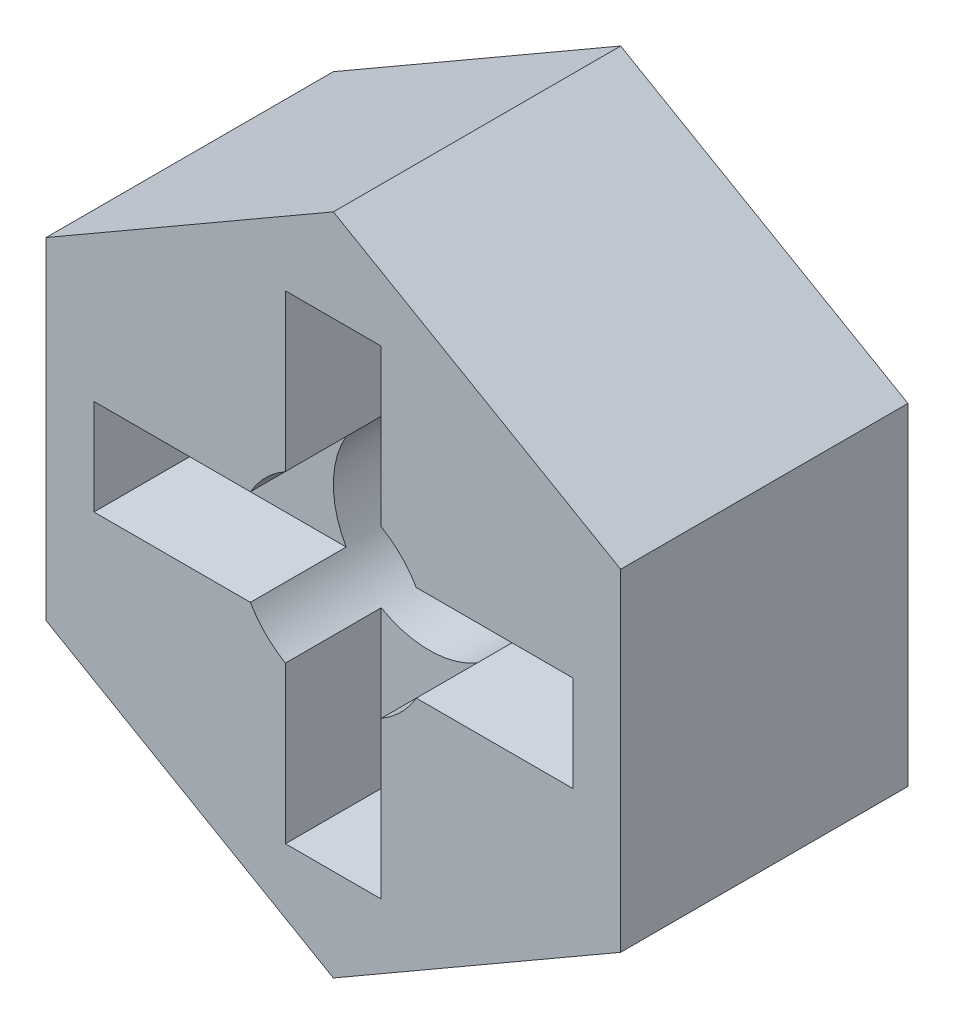
ISO-10303-21;
HEADER;
FILE_DESCRIPTION(('STEP AP214'),'2;1');
FILE_NAME('part.step','',(''),(''),'','','');
FILE_SCHEMA(('AUTOMOTIVE_DESIGN { 1 0 10303 214 1 1 1 1 }'));
ENDSEC;
DATA;
#1=APPLICATION_CONTEXT('core data for automotive mechanical design processes');
#2=APPLICATION_PROTOCOL_DEFINITION('international standard','automotive_design',2000,#1);
#3=PRODUCT_CONTEXT('',#1,'mechanical');
#4=PRODUCT('Part','Part','',(#3));
#5=PRODUCT_RELATED_PRODUCT_CATEGORY('part','',(#4));
#6=PRODUCT_DEFINITION_FORMATION('','',#4);
#7=PRODUCT_DEFINITION_CONTEXT('part definition',#1,'design');
#8=PRODUCT_DEFINITION('design','',#6,#7);
#9=PRODUCT_DEFINITION_SHAPE('','',#8);
#10=(LENGTH_UNIT() NAMED_UNIT(*) SI_UNIT(.MILLI.,.METRE.));
#11=(NAMED_UNIT(*) PLANE_ANGLE_UNIT() SI_UNIT($,.RADIAN.));
#12=(NAMED_UNIT(*) SI_UNIT($,.STERADIAN.) SOLID_ANGLE_UNIT());
#13=UNCERTAINTY_MEASURE_WITH_UNIT(LENGTH_MEASURE(1.E-05),#10,'distance_accuracy_value','');
#14=(GEOMETRIC_REPRESENTATION_CONTEXT(3) GLOBAL_UNCERTAINTY_ASSIGNED_CONTEXT((#13)) GLOBAL_UNIT_ASSIGNED_CONTEXT((#10,
#11,#12)) REPRESENTATION_CONTEXT('',''));
#15=CARTESIAN_POINT('',(0.,0.,0.));
#16=DIRECTION('',(0.,0.,1.));
#17=DIRECTION('',(1.,0.,0.));
#18=AXIS2_PLACEMENT_3D('',#15,#16,#17);
#19=CARTESIAN_POINT('',(6.00000000000001,3.46410161513783,0.));
#20=DIRECTION('',(0.,0.,-1.));
#21=DIRECTION('',(-1.,0.,0.));
#22=AXIS2_PLACEMENT_3D('',#19,#20,#21);
#23=PLANE('',#22);
#24=CARTESIAN_POINT('',(0.,0.,0.));
#25=DIRECTION('',(0.,0.,1.));
#26=DIRECTION('',(1.,0.,0.));
#27=AXIS2_PLACEMENT_3D('',#24,#25,#26);
#28=CIRCLE('',#27,2.);
#29=CARTESIAN_POINT('',(2.,0.,0.));
#30=VERTEX_POINT('',#29);
#31=EDGE_CURVE('E254',#30,#30,#28,.T.);
#32=ORIENTED_EDGE('',*,*,#31,.T.);
#33=EDGE_LOOP('',(#32));
#34=FACE_BOUND('',#33,.T.);
#35=CARTESIAN_POINT('',(0.,0.,0.));
#36=DIRECTION('',(0.,0.,-1.));
#37=DIRECTION('',(-1.,0.,0.));
#38=AXIS2_PLACEMENT_3D('',#35,#36,#37);
#39=CIRCLE('',#38,4.);
#40=CARTESIAN_POINT('',(-4.00000000000001,0.,0.));
#41=VERTEX_POINT('',#40);
#42=EDGE_CURVE('E505',#41,#41,#39,.T.);
#43=ORIENTED_EDGE('',*,*,#42,.T.);
#44=EDGE_LOOP('',(#43));
#45=FACE_BOUND('',#44,.T.);
#46=ADVANCED_FACE('F31',(#34,#45),#23,.T.);
#47=CARTESIAN_POINT('',(6.00000000000001,3.46410161513783,6.00000000000003));
#48=DIRECTION('',(0.,0.,-1.));
#49=DIRECTION('',(-1.,0.,0.));
#50=AXIS2_PLACEMENT_3D('',#47,#48,#49);
#51=PLANE('',#50);
#52=DIRECTION('',(-0.866025403784441,0.5,0.));
#53=VECTOR('',#52,1.);
#54=CARTESIAN_POINT('',(6.00000000000001,3.46410161513783,6.00000000000003));
#55=LINE('',#54,#53);
#56=CARTESIAN_POINT('',(6.00000000000001,3.46410161513783,6.00000000000003));
#57=VERTEX_POINT('',#56);
#58=CARTESIAN_POINT('',(0.,6.92820323027557,6.));
#59=VERTEX_POINT('',#58);
#60=EDGE_CURVE('E289',#57,#59,#55,.T.);
#61=ORIENTED_EDGE('',*,*,#60,.T.);
#62=DIRECTION('',(-0.866025403784439,-0.499999999999999,0.));
#63=VECTOR('',#62,1.);
#64=CARTESIAN_POINT('',(0.,6.92820323027557,6.));
#65=LINE('',#64,#63);
#66=CARTESIAN_POINT('',(-6.00000000000001,3.4641016151378,6.));
#67=VERTEX_POINT('',#66);
#68=EDGE_CURVE('E292',#59,#67,#65,.T.);
#69=ORIENTED_EDGE('',*,*,#68,.T.);
#70=DIRECTION('',(0.,-0.999999999999999,0.));
#71=VECTOR('',#70,1.);
#72=CARTESIAN_POINT('',(-6.00000000000001,3.4641016151378,6.));
#73=LINE('',#72,#71);
#74=CARTESIAN_POINT('',(-6.00000000000003,-3.46410161513769,6.));
#75=VERTEX_POINT('',#74);
#76=EDGE_CURVE('E294',#67,#75,#73,.T.);
#77=ORIENTED_EDGE('',*,*,#76,.T.);
#78=DIRECTION('',(0.866025403784441,-0.5,0.));
#79=VECTOR('',#78,1.);
#80=CARTESIAN_POINT('',(-6.00000000000003,-3.46410161513769,6.));
#81=LINE('',#80,#79);
#82=CARTESIAN_POINT('',(0.,-6.92820323027543,6.));
#83=VERTEX_POINT('',#82);
#84=EDGE_CURVE('E296',#75,#83,#81,.T.);
#85=ORIENTED_EDGE('',*,*,#84,.T.);
#86=DIRECTION('',(0.866025403784439,0.499999999999999,0.));
#87=VECTOR('',#86,1.);
#88=CARTESIAN_POINT('',(0.,-6.92820323027543,6.));
#89=LINE('',#88,#87);
#90=CARTESIAN_POINT('',(6.00000000000001,-3.46410161513769,6.));
#91=VERTEX_POINT('',#90);
#92=EDGE_CURVE('E298',#83,#91,#89,.T.);
#93=ORIENTED_EDGE('',*,*,#92,.T.);
#94=DIRECTION('',(0.,0.999999999999999,0.));
#95=VECTOR('',#94,1.);
#96=CARTESIAN_POINT('',(6.00000000000001,-3.46410161513769,6.));
#97=LINE('',#96,#95);
#98=EDGE_CURVE('E300',#91,#57,#97,.T.);
#99=ORIENTED_EDGE('',*,*,#98,.T.);
#100=EDGE_LOOP('',(#61,#69,#77,#85,#93,#99));
#101=FACE_BOUND('',#100,.T.);
#102=CARTESIAN_POINT('',(0.,0.,6.));
#103=DIRECTION('',(0.,0.,1.));
#104=DIRECTION('',(1.,0.,0.));
#105=AXIS2_PLACEMENT_3D('',#102,#103,#104);
#106=CIRCLE('',#105,2.);
#107=CARTESIAN_POINT('',(-1.,1.73205080756889,6.));
#108=VERTEX_POINT('',#107);
#109=CARTESIAN_POINT('',(-1.73205080756886,1.00000000000003,6.));
#110=VERTEX_POINT('',#109);
#111=EDGE_CURVE('E276',#108,#110,#106,.T.);
#112=ORIENTED_EDGE('',*,*,#111,.F.);
#113=DIRECTION('',(0.,-0.999999999999999,0.));
#114=VECTOR('',#113,1.);
#115=CARTESIAN_POINT('',(-1.00000000000001,5.,6.));
#116=LINE('',#115,#114);
#117=CARTESIAN_POINT('',(-1.00000000000001,5.,6.));
#118=VERTEX_POINT('',#117);
#119=EDGE_CURVE('E194',#118,#108,#116,.T.);
#120=ORIENTED_EDGE('',*,*,#119,.F.);
#121=DIRECTION('',(-1.,0.,0.));
#122=VECTOR('',#121,1.);
#123=CARTESIAN_POINT('',(1.,5.,6.));
#124=LINE('',#123,#122);
#125=CARTESIAN_POINT('',(1.,5.,6.));
#126=VERTEX_POINT('',#125);
#127=EDGE_CURVE('E228',#126,#118,#124,.T.);
#128=ORIENTED_EDGE('',*,*,#127,.F.);
#129=DIRECTION('',(0.,0.999999999999999,0.));
#130=VECTOR('',#129,1.);
#131=CARTESIAN_POINT('',(1.,5.,6.));
#132=LINE('',#131,#130);
#133=CARTESIAN_POINT('',(1.,1.73205080756891,6.));
#134=VERTEX_POINT('',#133);
#135=EDGE_CURVE('E226',#134,#126,#132,.T.);
#136=ORIENTED_EDGE('',*,*,#135,.F.);
#137=CARTESIAN_POINT('',(1.73205080756891,1.,6.));
#138=VERTEX_POINT('',#137);
#139=EDGE_CURVE('E272',#138,#134,#106,.T.);
#140=ORIENTED_EDGE('',*,*,#139,.F.);
#141=DIRECTION('',(-1.,0.,0.));
#142=VECTOR('',#141,1.);
#143=CARTESIAN_POINT('',(5.,1.,6.));
#144=LINE('',#143,#142);
#145=CARTESIAN_POINT('',(5.,1.,6.));
#146=VERTEX_POINT('',#145);
#147=EDGE_CURVE('E224',#146,#138,#144,.T.);
#148=ORIENTED_EDGE('',*,*,#147,.F.);
#149=DIRECTION('',(0.,0.999999999999999,0.));
#150=VECTOR('',#149,1.);
#151=CARTESIAN_POINT('',(5.,-1.,6.));
#152=LINE('',#151,#150);
#153=CARTESIAN_POINT('',(5.,-1.,6.));
#154=VERTEX_POINT('',#153);
#155=EDGE_CURVE('E221',#154,#146,#152,.T.);
#156=ORIENTED_EDGE('',*,*,#155,.F.);
#157=DIRECTION('',(1.,0.,0.));
#158=VECTOR('',#157,1.);
#159=CARTESIAN_POINT('',(5.,-1.,6.));
#160=LINE('',#159,#158);
#161=CARTESIAN_POINT('',(1.73205080756886,-1.,6.));
#162=VERTEX_POINT('',#161);
#163=EDGE_CURVE('E219',#162,#154,#160,.T.);
#164=ORIENTED_EDGE('',*,*,#163,.F.);
#165=CARTESIAN_POINT('',(0.999999999999973,-1.73205080756889,6.));
#166=VERTEX_POINT('',#165);
#167=EDGE_CURVE('E271',#166,#162,#106,.T.);
#168=ORIENTED_EDGE('',*,*,#167,.F.);
#169=DIRECTION('',(0.,0.999999999999999,0.));
#170=VECTOR('',#169,1.);
#171=CARTESIAN_POINT('',(0.999999999999959,-5.,6.));
#172=LINE('',#171,#170);
#173=CARTESIAN_POINT('',(0.999999999999959,-5.,6.));
#174=VERTEX_POINT('',#173);
#175=EDGE_CURVE('E217',#174,#166,#172,.T.);
#176=ORIENTED_EDGE('',*,*,#175,.F.);
#177=DIRECTION('',(1.,0.,0.));
#178=VECTOR('',#177,1.);
#179=CARTESIAN_POINT('',(-1.00000000000003,-4.99999999999998,6.));
#180=LINE('',#179,#178);
#181=CARTESIAN_POINT('',(-1.00000000000003,-4.99999999999998,6.));
#182=VERTEX_POINT('',#181);
#183=EDGE_CURVE('E214',#182,#174,#180,.T.);
#184=ORIENTED_EDGE('',*,*,#183,.F.);
#185=DIRECTION('',(0.,-0.999999999999999,0.));
#186=VECTOR('',#185,1.);
#187=CARTESIAN_POINT('',(-1.00000000000003,-4.99999999999998,6.));
#188=LINE('',#187,#186);
#189=CARTESIAN_POINT('',(-0.999999999999973,-1.73205080756886,6.));
#190=VERTEX_POINT('',#189);
#191=EDGE_CURVE('E209',#190,#182,#188,.T.);
#192=ORIENTED_EDGE('',*,*,#191,.F.);
#193=CARTESIAN_POINT('',(-1.73205080756883,-0.999999999999945,6.));
#194=VERTEX_POINT('',#193);
#195=EDGE_CURVE('E362',#194,#190,#106,.T.);
#196=ORIENTED_EDGE('',*,*,#195,.F.);
#197=DIRECTION('',(1.,0.,0.));
#198=VECTOR('',#197,1.);
#199=CARTESIAN_POINT('',(-5.00000000000002,-0.999999999999918,6.));
#200=LINE('',#199,#198);
#201=CARTESIAN_POINT('',(-5.00000000000002,-0.999999999999918,6.));
#202=VERTEX_POINT('',#201);
#203=EDGE_CURVE('E207',#202,#194,#200,.T.);
#204=ORIENTED_EDGE('',*,*,#203,.F.);
#205=DIRECTION('',(0.,-0.999999999999999,0.));
#206=VECTOR('',#205,1.);
#207=CARTESIAN_POINT('',(-4.99999999999998,1.00000000000006,6.));
#208=LINE('',#207,#206);
#209=CARTESIAN_POINT('',(-4.99999999999998,1.00000000000006,6.));
#210=VERTEX_POINT('',#209);
#211=EDGE_CURVE('E193',#210,#202,#208,.T.);
#212=ORIENTED_EDGE('',*,*,#211,.F.);
#213=DIRECTION('',(-1.,0.,0.));
#214=VECTOR('',#213,1.);
#215=CARTESIAN_POINT('',(-4.99999999999998,1.00000000000006,6.));
#216=LINE('',#215,#214);
#217=EDGE_CURVE('E181',#110,#210,#216,.T.);
#218=ORIENTED_EDGE('',*,*,#217,.F.);
#219=EDGE_LOOP('',(#112,#120,#128,#136,#140,#148,#156,#164,#168,#176,#184,#192,#196,#204,#212,#218));
#220=FACE_BOUND('',#219,.T.);
#221=ADVANCED_FACE('F205',(#101,#220),#51,.F.);
#222=CARTESIAN_POINT('',(0.,0.,0.));
#223=DIRECTION('',(0.,0.,-1.));
#224=DIRECTION('',(-1.,0.,0.));
#225=AXIS2_PLACEMENT_3D('',#222,#223,#224);
#226=CIRCLE('',#225,5.);
#227=CARTESIAN_POINT('',(-5.00000000000001,0.,0.));
#228=VERTEX_POINT('',#227);
#229=EDGE_CURVE('E419',#228,#228,#226,.T.);
#230=ORIENTED_EDGE('',*,*,#229,.F.);
#231=EDGE_LOOP('',(#230));
#232=FACE_BOUND('',#231,.T.);
#233=DIRECTION('',(-0.866025403784441,0.5,0.));
#234=VECTOR('',#233,1.);
#235=CARTESIAN_POINT('',(6.00000000000001,3.46410161513783,0.));
#236=LINE('',#235,#234);
#237=CARTESIAN_POINT('',(6.00000000000001,3.46410161513783,0.));
#238=VERTEX_POINT('',#237);
#239=CARTESIAN_POINT('',(0.,6.92820323027557,0.));
#240=VERTEX_POINT('',#239);
#241=EDGE_CURVE('E275',#238,#240,#236,.T.);
#242=ORIENTED_EDGE('',*,*,#241,.F.);
#243=DIRECTION('',(0.,0.999999999999999,0.));
#244=VECTOR('',#243,1.);
#245=CARTESIAN_POINT('',(6.00000000000001,-3.46410161513769,0.));
#246=LINE('',#245,#244);
#247=CARTESIAN_POINT('',(6.00000000000001,-3.46410161513769,0.));
#248=VERTEX_POINT('',#247);
#249=EDGE_CURVE('E287',#248,#238,#246,.T.);
#250=ORIENTED_EDGE('',*,*,#249,.F.);
#251=DIRECTION('',(0.866025403784439,0.499999999999999,0.));
#252=VECTOR('',#251,1.);
#253=CARTESIAN_POINT('',(0.,-6.92820323027543,0.));
#254=LINE('',#253,#252);
#255=CARTESIAN_POINT('',(0.,-6.92820323027543,0.));
#256=VERTEX_POINT('',#255);
#257=EDGE_CURVE('E285',#256,#248,#254,.T.);
#258=ORIENTED_EDGE('',*,*,#257,.F.);
#259=DIRECTION('',(0.866025403784441,-0.5,0.));
#260=VECTOR('',#259,1.);
#261=CARTESIAN_POINT('',(-6.00000000000003,-3.46410161513769,0.));
#262=LINE('',#261,#260);
#263=CARTESIAN_POINT('',(-6.00000000000003,-3.46410161513769,0.));
#264=VERTEX_POINT('',#263);
#265=EDGE_CURVE('E283',#264,#256,#262,.T.);
#266=ORIENTED_EDGE('',*,*,#265,.F.);
#267=DIRECTION('',(0.,-0.999999999999999,0.));
#268=VECTOR('',#267,1.);
#269=CARTESIAN_POINT('',(-6.00000000000001,3.4641016151378,0.));
#270=LINE('',#269,#268);
#271=CARTESIAN_POINT('',(-6.00000000000001,3.4641016151378,0.));
#272=VERTEX_POINT('',#271);
#273=EDGE_CURVE('E281',#272,#264,#270,.T.);
#274=ORIENTED_EDGE('',*,*,#273,.F.);
#275=DIRECTION('',(-0.866025403784439,-0.499999999999999,0.));
#276=VECTOR('',#275,1.);
#277=CARTESIAN_POINT('',(0.,6.92820323027557,0.));
#278=LINE('',#277,#276);
#279=EDGE_CURVE('E279',#240,#272,#278,.T.);
#280=ORIENTED_EDGE('',*,*,#279,.F.);
#281=EDGE_LOOP('',(#242,#250,#258,#266,#274,#280));
#282=FACE_BOUND('',#281,.T.);
#283=ADVANCED_FACE('F401',(#232,#282),#23,.T.);
#284=CARTESIAN_POINT('',(6.00000000000001,3.46410161513783,6.00000000000003));
#285=DIRECTION('',(-0.5,-0.866025403784438,0.));
#286=DIRECTION('',(0.866025403784441,-0.5,0.));
#287=AXIS2_PLACEMENT_3D('',#284,#285,#286);
#288=PLANE('',#287);
#289=ORIENTED_EDGE('',*,*,#241,.T.);
#290=DIRECTION('',(0.,0.,-1.));
#291=VECTOR('',#290,1.);
#292=CARTESIAN_POINT('',(0.,6.92820323027557,6.));
#293=LINE('',#292,#291);
#294=EDGE_CURVE('E317',#59,#240,#293,.T.);
#295=ORIENTED_EDGE('',*,*,#294,.F.);
#296=ORIENTED_EDGE('',*,*,#60,.F.);
#297=DIRECTION('',(0.,0.,-1.));
#298=VECTOR('',#297,1.);
#299=CARTESIAN_POINT('',(6.00000000000001,3.46410161513783,6.00000000000003));
#300=LINE('',#299,#298);
#301=EDGE_CURVE('E302',#57,#238,#300,.T.);
#302=ORIENTED_EDGE('',*,*,#301,.T.);
#303=EDGE_LOOP('',(#289,#295,#296,#302));
#304=FACE_BOUND('',#303,.T.);
#305=ADVANCED_FACE('F33',(#304),#288,.F.);
#306=CARTESIAN_POINT('',(0.,6.92820323027557,6.));
#307=DIRECTION('',(0.500000000000002,-0.866025403784439,0.));
#308=DIRECTION('',(0.866025403784439,0.499999999999999,0.));
#309=AXIS2_PLACEMENT_3D('',#306,#307,#308);
#310=PLANE('',#309);
#311=ORIENTED_EDGE('',*,*,#279,.T.);
#312=DIRECTION('',(0.,0.,-1.));
#313=VECTOR('',#312,1.);
#314=CARTESIAN_POINT('',(-6.00000000000001,3.4641016151378,6.));
#315=LINE('',#314,#313);
#316=EDGE_CURVE('E314',#67,#272,#315,.T.);
#317=ORIENTED_EDGE('',*,*,#316,.F.);
#318=ORIENTED_EDGE('',*,*,#68,.F.);
#319=ORIENTED_EDGE('',*,*,#294,.T.);
#320=EDGE_LOOP('',(#311,#317,#318,#319));
#321=FACE_BOUND('',#320,.T.);
#322=ADVANCED_FACE('F414',(#321),#310,.F.);
#323=CARTESIAN_POINT('',(-6.00000000000001,3.4641016151378,6.));
#324=DIRECTION('',(1.,0.,0.));
#325=DIRECTION('',(0.,0.999999999999999,0.));
#326=AXIS2_PLACEMENT_3D('',#323,#324,#325);
#327=PLANE('',#326);
#328=ORIENTED_EDGE('',*,*,#273,.T.);
#329=DIRECTION('',(0.,0.,-1.));
#330=VECTOR('',#329,1.);
#331=CARTESIAN_POINT('',(-6.00000000000003,-3.46410161513769,6.));
#332=LINE('',#331,#330);
#333=EDGE_CURVE('E311',#75,#264,#332,.T.);
#334=ORIENTED_EDGE('',*,*,#333,.F.);
#335=ORIENTED_EDGE('',*,*,#76,.F.);
#336=ORIENTED_EDGE('',*,*,#316,.T.);
#337=EDGE_LOOP('',(#328,#334,#335,#336));
#338=FACE_BOUND('',#337,.T.);
#339=ADVANCED_FACE('F442',(#338),#327,.F.);
#340=CARTESIAN_POINT('',(-6.00000000000003,-3.46410161513769,6.));
#341=DIRECTION('',(0.5,0.866025403784437,0.));
#342=DIRECTION('',(-0.866025403784441,0.5,0.));
#343=AXIS2_PLACEMENT_3D('',#340,#341,#342);
#344=PLANE('',#343);
#345=ORIENTED_EDGE('',*,*,#265,.T.);
#346=DIRECTION('',(0.,0.,-1.));
#347=VECTOR('',#346,1.);
#348=CARTESIAN_POINT('',(0.,-6.92820323027543,6.));
#349=LINE('',#348,#347);
#350=EDGE_CURVE('E308',#83,#256,#349,.T.);
#351=ORIENTED_EDGE('',*,*,#350,.F.);
#352=ORIENTED_EDGE('',*,*,#84,.F.);
#353=ORIENTED_EDGE('',*,*,#333,.T.);
#354=EDGE_LOOP('',(#345,#351,#352,#353));
#355=FACE_BOUND('',#354,.T.);
#356=ADVANCED_FACE('F437',(#355),#344,.F.);
#357=CARTESIAN_POINT('',(0.,-6.92820323027543,6.));
#358=DIRECTION('',(-0.500000000000001,0.866025403784439,0.));
#359=DIRECTION('',(-0.866025403784439,-0.499999999999999,0.));
#360=AXIS2_PLACEMENT_3D('',#357,#358,#359);
#361=PLANE('',#360);
#362=ORIENTED_EDGE('',*,*,#257,.T.);
#363=DIRECTION('',(0.,0.,-1.));
#364=VECTOR('',#363,1.);
#365=CARTESIAN_POINT('',(6.00000000000001,-3.46410161513769,6.));
#366=LINE('',#365,#364);
#367=EDGE_CURVE('E305',#91,#248,#366,.T.);
#368=ORIENTED_EDGE('',*,*,#367,.F.);
#369=ORIENTED_EDGE('',*,*,#92,.F.);
#370=ORIENTED_EDGE('',*,*,#350,.T.);
#371=EDGE_LOOP('',(#362,#368,#369,#370));
#372=FACE_BOUND('',#371,.T.);
#373=ADVANCED_FACE('F433',(#372),#361,.F.);
#374=CARTESIAN_POINT('',(6.00000000000001,-3.46410161513769,6.));
#375=DIRECTION('',(-1.,0.,0.));
#376=DIRECTION('',(0.,0.,1.));
#377=AXIS2_PLACEMENT_3D('',#374,#375,#376);
#378=PLANE('',#377);
#379=ORIENTED_EDGE('',*,*,#249,.T.);
#380=ORIENTED_EDGE('',*,*,#301,.F.);
#381=ORIENTED_EDGE('',*,*,#98,.F.);
#382=ORIENTED_EDGE('',*,*,#367,.T.);
#383=EDGE_LOOP('',(#379,#380,#381,#382));
#384=FACE_BOUND('',#383,.T.);
#385=ADVANCED_FACE('F429',(#384),#378,.F.);
#386=CARTESIAN_POINT('',(0.,0.,6.));
#387=DIRECTION('',(0.,0.,-1.));
#388=DIRECTION('',(-1.,0.,0.));
#389=AXIS2_PLACEMENT_3D('',#386,#387,#388);
#390=CYLINDRICAL_SURFACE('',#389,2.);
#391=DIRECTION('',(0.,0.,-1.));
#392=VECTOR('',#391,1.);
#393=CARTESIAN_POINT('',(-1.,1.73205080756889,6.));
#394=LINE('',#393,#392);
#395=CARTESIAN_POINT('',(-1.,1.73205080756889,4.));
#396=VERTEX_POINT('',#395);
#397=EDGE_CURVE('E11',#108,#396,#394,.T.);
#398=ORIENTED_EDGE('',*,*,#397,.F.);
#399=ORIENTED_EDGE('',*,*,#111,.T.);
#400=DIRECTION('',(0.,0.,-1.));
#401=VECTOR('',#400,1.);
#402=CARTESIAN_POINT('',(-1.73205080756886,1.00000000000003,6.));
#403=LINE('',#402,#401);
#404=CARTESIAN_POINT('',(-1.73205080756886,1.00000000000003,4.));
#405=VERTEX_POINT('',#404);
#406=EDGE_CURVE('E188',#405,#110,#403,.F.);
#407=ORIENTED_EDGE('',*,*,#406,.F.);
#408=CARTESIAN_POINT('',(0.,0.,4.));
#409=DIRECTION('',(0.,0.,-1.));
#410=DIRECTION('',(-1.,0.,0.));
#411=AXIS2_PLACEMENT_3D('',#408,#409,#410);
#412=CIRCLE('',#411,2.);
#413=CARTESIAN_POINT('',(-1.73205080756883,-0.999999999999945,4.));
#414=VERTEX_POINT('',#413);
#415=EDGE_CURVE('E320',#414,#405,#412,.T.);
#416=ORIENTED_EDGE('',*,*,#415,.F.);
#417=DIRECTION('',(0.,0.,-1.));
#418=VECTOR('',#417,1.);
#419=CARTESIAN_POINT('',(-1.73205080756883,-0.999999999999945,6.));
#420=LINE('',#419,#418);
#421=EDGE_CURVE('E325',#194,#414,#420,.T.);
#422=ORIENTED_EDGE('',*,*,#421,.F.);
#423=ORIENTED_EDGE('',*,*,#195,.T.);
#424=DIRECTION('',(0.,0.,-1.));
#425=VECTOR('',#424,1.);
#426=CARTESIAN_POINT('',(-0.999999999999973,-1.73205080756886,6.));
#427=LINE('',#426,#425);
#428=CARTESIAN_POINT('',(-0.999999999999973,-1.73205080756886,4.));
#429=VERTEX_POINT('',#428);
#430=EDGE_CURVE('E328',#429,#190,#427,.F.);
#431=ORIENTED_EDGE('',*,*,#430,.F.);
#432=CARTESIAN_POINT('',(0.999999999999973,-1.73205080756889,4.));
#433=VERTEX_POINT('',#432);
#434=EDGE_CURVE('E323',#433,#429,#412,.T.);
#435=ORIENTED_EDGE('',*,*,#434,.F.);
#436=DIRECTION('',(0.,0.,-1.));
#437=VECTOR('',#436,1.);
#438=CARTESIAN_POINT('',(0.999999999999973,-1.73205080756889,6.));
#439=LINE('',#438,#437);
#440=EDGE_CURVE('E330',#166,#433,#439,.T.);
#441=ORIENTED_EDGE('',*,*,#440,.F.);
#442=ORIENTED_EDGE('',*,*,#167,.T.);
#443=DIRECTION('',(0.,0.,-1.));
#444=VECTOR('',#443,1.);
#445=CARTESIAN_POINT('',(1.73205080756886,-1.,6.));
#446=LINE('',#445,#444);
#447=CARTESIAN_POINT('',(1.73205080756886,-1.,4.));
#448=VERTEX_POINT('',#447);
#449=EDGE_CURVE('E334',#448,#162,#446,.F.);
#450=ORIENTED_EDGE('',*,*,#449,.F.);
#451=CARTESIAN_POINT('',(1.73205080756891,1.,4.));
#452=VERTEX_POINT('',#451);
#453=EDGE_CURVE('E333',#452,#448,#412,.T.);
#454=ORIENTED_EDGE('',*,*,#453,.F.);
#455=DIRECTION('',(0.,0.,-1.));
#456=VECTOR('',#455,1.);
#457=CARTESIAN_POINT('',(1.73205080756891,1.,6.));
#458=LINE('',#457,#456);
#459=EDGE_CURVE('E336',#138,#452,#458,.T.);
#460=ORIENTED_EDGE('',*,*,#459,.F.);
#461=ORIENTED_EDGE('',*,*,#139,.T.);
#462=DIRECTION('',(0.,0.,-1.));
#463=VECTOR('',#462,1.);
#464=CARTESIAN_POINT('',(1.,1.73205080756891,6.));
#465=LINE('',#464,#463);
#466=CARTESIAN_POINT('',(1.,1.73205080756891,4.));
#467=VERTEX_POINT('',#466);
#468=EDGE_CURVE('E39',#467,#134,#465,.F.);
#469=ORIENTED_EDGE('',*,*,#468,.F.);
#470=EDGE_CURVE('E322',#396,#467,#412,.T.);
#471=ORIENTED_EDGE('',*,*,#470,.F.);
#472=EDGE_LOOP('',(#398,#399,#407,#416,#422,#423,#431,#435,#441,#442,#450,#454,#460,#461,#469,#471));
#473=FACE_BOUND('',#472,.T.);
#474=ORIENTED_EDGE('',*,*,#31,.F.);
#475=EDGE_LOOP('',(#474));
#476=FACE_BOUND('',#475,.T.);
#477=ADVANCED_FACE('F359',(#473,#476),#390,.F.);
#478=CARTESIAN_POINT('',(-1.00000000000001,5.,4.));
#479=DIRECTION('',(0.,0.,-1.));
#480=DIRECTION('',(-1.,0.,0.));
#481=AXIS2_PLACEMENT_3D('',#478,#479,#480);
#482=PLANE('',#481);
#483=ORIENTED_EDGE('',*,*,#415,.T.);
#484=DIRECTION('',(-1.,0.,0.));
#485=VECTOR('',#484,1.);
#486=CARTESIAN_POINT('',(-4.99999999999998,1.00000000000006,4.));
#487=LINE('',#486,#485);
#488=CARTESIAN_POINT('',(-4.99999999999998,1.00000000000006,4.));
#489=VERTEX_POINT('',#488);
#490=EDGE_CURVE('E232',#405,#489,#487,.T.);
#491=ORIENTED_EDGE('',*,*,#490,.T.);
#492=DIRECTION('',(0.,-0.999999999999999,0.));
#493=VECTOR('',#492,1.);
#494=CARTESIAN_POINT('',(-4.99999999999998,1.00000000000006,4.));
#495=LINE('',#494,#493);
#496=CARTESIAN_POINT('',(-5.00000000000002,-0.999999999999918,4.));
#497=VERTEX_POINT('',#496);
#498=EDGE_CURVE('E201',#489,#497,#495,.T.);
#499=ORIENTED_EDGE('',*,*,#498,.T.);
#500=DIRECTION('',(1.,0.,0.));
#501=VECTOR('',#500,1.);
#502=CARTESIAN_POINT('',(-5.00000000000002,-0.999999999999918,4.));
#503=LINE('',#502,#501);
#504=EDGE_CURVE('E235',#497,#414,#503,.T.);
#505=ORIENTED_EDGE('',*,*,#504,.T.);
#506=EDGE_LOOP('',(#483,#491,#499,#505));
#507=FACE_BOUND('',#506,.T.);
#508=ADVANCED_FACE('F392',(#507),#482,.F.);
#509=CARTESIAN_POINT('',(-4.99999999999998,1.00000000000006,4.));
#510=DIRECTION('',(0.,0.999999999999999,0.));
#511=DIRECTION('',(-1.,0.,0.));
#512=AXIS2_PLACEMENT_3D('',#509,#510,#511);
#513=PLANE('',#512);
#514=ORIENTED_EDGE('',*,*,#406,.T.);
#515=ORIENTED_EDGE('',*,*,#217,.T.);
#516=DIRECTION('',(0.,0.,1.));
#517=VECTOR('',#516,1.);
#518=CARTESIAN_POINT('',(-4.99999999999998,1.00000000000006,4.));
#519=LINE('',#518,#517);
#520=EDGE_CURVE('E185',#489,#210,#519,.T.);
#521=ORIENTED_EDGE('',*,*,#520,.F.);
#522=ORIENTED_EDGE('',*,*,#490,.F.);
#523=EDGE_LOOP('',(#514,#515,#521,#522));
#524=FACE_BOUND('',#523,.T.);
#525=ADVANCED_FACE('F183',(#524),#513,.F.);
#526=CARTESIAN_POINT('',(-5.00000000000002,-0.999999999999918,4.));
#527=DIRECTION('',(0.,-0.999999999999999,0.));
#528=DIRECTION('',(1.,0.,0.));
#529=AXIS2_PLACEMENT_3D('',#526,#527,#528);
#530=PLANE('',#529);
#531=ORIENTED_EDGE('',*,*,#421,.T.);
#532=ORIENTED_EDGE('',*,*,#504,.F.);
#533=DIRECTION('',(0.,0.,1.));
#534=VECTOR('',#533,1.);
#535=CARTESIAN_POINT('',(-5.00000000000002,-0.999999999999918,4.));
#536=LINE('',#535,#534);
#537=EDGE_CURVE('E202',#497,#202,#536,.T.);
#538=ORIENTED_EDGE('',*,*,#537,.T.);
#539=ORIENTED_EDGE('',*,*,#203,.T.);
#540=EDGE_LOOP('',(#531,#532,#538,#539));
#541=FACE_BOUND('',#540,.T.);
#542=ADVANCED_FACE('F470',(#541),#530,.F.);
#543=CARTESIAN_POINT('',(-4.99999999999998,1.00000000000006,4.));
#544=DIRECTION('',(-1.,0.,0.));
#545=DIRECTION('',(0.,-0.999999999999999,0.));
#546=AXIS2_PLACEMENT_3D('',#543,#544,#545);
#547=PLANE('',#546);
#548=ORIENTED_EDGE('',*,*,#211,.T.);
#549=ORIENTED_EDGE('',*,*,#537,.F.);
#550=ORIENTED_EDGE('',*,*,#498,.F.);
#551=ORIENTED_EDGE('',*,*,#520,.T.);
#552=EDGE_LOOP('',(#548,#549,#550,#551));
#553=FACE_BOUND('',#552,.T.);
#554=ADVANCED_FACE('F198',(#553),#547,.F.);
#555=ORIENTED_EDGE('',*,*,#434,.T.);
#556=DIRECTION('',(0.,-0.999999999999999,0.));
#557=VECTOR('',#556,1.);
#558=CARTESIAN_POINT('',(-1.00000000000003,-4.99999999999998,4.));
#559=LINE('',#558,#557);
#560=CARTESIAN_POINT('',(-1.00000000000003,-4.99999999999998,4.));
#561=VERTEX_POINT('',#560);
#562=EDGE_CURVE('E237',#429,#561,#559,.T.);
#563=ORIENTED_EDGE('',*,*,#562,.T.);
#564=DIRECTION('',(1.,0.,0.));
#565=VECTOR('',#564,1.);
#566=CARTESIAN_POINT('',(-1.00000000000003,-4.99999999999998,4.));
#567=LINE('',#566,#565);
#568=CARTESIAN_POINT('',(0.999999999999959,-5.,4.));
#569=VERTEX_POINT('',#568);
#570=EDGE_CURVE('E239',#561,#569,#567,.T.);
#571=ORIENTED_EDGE('',*,*,#570,.T.);
#572=DIRECTION('',(0.,0.999999999999999,0.));
#573=VECTOR('',#572,1.);
#574=CARTESIAN_POINT('',(0.999999999999959,-5.,4.));
#575=LINE('',#574,#573);
#576=EDGE_CURVE('E242',#569,#433,#575,.T.);
#577=ORIENTED_EDGE('',*,*,#576,.T.);
#578=EDGE_LOOP('',(#555,#563,#571,#577));
#579=FACE_BOUND('',#578,.T.);
#580=ADVANCED_FACE('F347',(#579),#482,.F.);
#581=CARTESIAN_POINT('',(-1.00000000000003,-4.99999999999998,4.));
#582=DIRECTION('',(-1.,0.,0.));
#583=DIRECTION('',(0.,-0.999999999999999,0.));
#584=AXIS2_PLACEMENT_3D('',#581,#582,#583);
#585=PLANE('',#584);
#586=ORIENTED_EDGE('',*,*,#430,.T.);
#587=ORIENTED_EDGE('',*,*,#191,.T.);
#588=DIRECTION('',(0.,0.,1.));
#589=VECTOR('',#588,1.);
#590=CARTESIAN_POINT('',(-1.00000000000003,-4.99999999999998,4.));
#591=LINE('',#590,#589);
#592=EDGE_CURVE('E265',#561,#182,#591,.T.);
#593=ORIENTED_EDGE('',*,*,#592,.F.);
#594=ORIENTED_EDGE('',*,*,#562,.F.);
#595=EDGE_LOOP('',(#586,#587,#593,#594));
#596=FACE_BOUND('',#595,.T.);
#597=ADVANCED_FACE('F354',(#596),#585,.F.);
#598=CARTESIAN_POINT('',(0.999999999999959,-5.,4.));
#599=DIRECTION('',(1.,0.,0.));
#600=DIRECTION('',(0.,0.999999999999999,0.));
#601=AXIS2_PLACEMENT_3D('',#598,#599,#600);
#602=PLANE('',#601);
#603=ORIENTED_EDGE('',*,*,#440,.T.);
#604=ORIENTED_EDGE('',*,*,#576,.F.);
#605=DIRECTION('',(0.,0.,1.));
#606=VECTOR('',#605,1.);
#607=CARTESIAN_POINT('',(0.999999999999959,-5.,4.));
#608=LINE('',#607,#606);
#609=EDGE_CURVE('E263',#569,#174,#608,.T.);
#610=ORIENTED_EDGE('',*,*,#609,.T.);
#611=ORIENTED_EDGE('',*,*,#175,.T.);
#612=EDGE_LOOP('',(#603,#604,#610,#611));
#613=FACE_BOUND('',#612,.T.);
#614=ADVANCED_FACE('F389',(#613),#602,.F.);
#615=CARTESIAN_POINT('',(-1.00000000000003,-4.99999999999998,4.));
#616=DIRECTION('',(0.,-0.999999999999999,0.));
#617=DIRECTION('',(1.,0.,0.));
#618=AXIS2_PLACEMENT_3D('',#615,#616,#617);
#619=PLANE('',#618);
#620=ORIENTED_EDGE('',*,*,#183,.T.);
#621=ORIENTED_EDGE('',*,*,#609,.F.);
#622=ORIENTED_EDGE('',*,*,#570,.F.);
#623=ORIENTED_EDGE('',*,*,#592,.T.);
#624=EDGE_LOOP('',(#620,#621,#622,#623));
#625=FACE_BOUND('',#624,.T.);
#626=ADVANCED_FACE('F380',(#625),#619,.F.);
#627=ORIENTED_EDGE('',*,*,#453,.T.);
#628=DIRECTION('',(1.,0.,0.));
#629=VECTOR('',#628,1.);
#630=CARTESIAN_POINT('',(5.,-1.,4.));
#631=LINE('',#630,#629);
#632=CARTESIAN_POINT('',(5.,-1.,4.));
#633=VERTEX_POINT('',#632);
#634=EDGE_CURVE('E244',#448,#633,#631,.T.);
#635=ORIENTED_EDGE('',*,*,#634,.T.);
#636=DIRECTION('',(0.,0.999999999999999,0.));
#637=VECTOR('',#636,1.);
#638=CARTESIAN_POINT('',(5.,-1.,4.));
#639=LINE('',#638,#637);
#640=CARTESIAN_POINT('',(5.,1.,4.));
#641=VERTEX_POINT('',#640);
#642=EDGE_CURVE('E246',#633,#641,#639,.T.);
#643=ORIENTED_EDGE('',*,*,#642,.T.);
#644=DIRECTION('',(-1.,0.,0.));
#645=VECTOR('',#644,1.);
#646=CARTESIAN_POINT('',(5.,1.,4.));
#647=LINE('',#646,#645);
#648=EDGE_CURVE('E53',#641,#452,#647,.T.);
#649=ORIENTED_EDGE('',*,*,#648,.T.);
#650=EDGE_LOOP('',(#627,#635,#643,#649));
#651=FACE_BOUND('',#650,.T.);
#652=ADVANCED_FACE('F378',(#651),#482,.F.);
#653=CARTESIAN_POINT('',(5.,-1.,4.));
#654=DIRECTION('',(0.,-0.999999999999999,0.));
#655=DIRECTION('',(1.,0.,0.));
#656=AXIS2_PLACEMENT_3D('',#653,#654,#655);
#657=PLANE('',#656);
#658=ORIENTED_EDGE('',*,*,#449,.T.);
#659=ORIENTED_EDGE('',*,*,#163,.T.);
#660=DIRECTION('',(0.,0.,1.));
#661=VECTOR('',#660,1.);
#662=CARTESIAN_POINT('',(5.,-1.,4.));
#663=LINE('',#662,#661);
#664=EDGE_CURVE('E260',#633,#154,#663,.T.);
#665=ORIENTED_EDGE('',*,*,#664,.F.);
#666=ORIENTED_EDGE('',*,*,#634,.F.);
#667=EDGE_LOOP('',(#658,#659,#665,#666));
#668=FACE_BOUND('',#667,.T.);
#669=ADVANCED_FACE('F374',(#668),#657,.F.);
#670=CARTESIAN_POINT('',(5.,1.,4.));
#671=DIRECTION('',(0.,0.999999999999999,0.));
#672=DIRECTION('',(-1.,0.,0.));
#673=AXIS2_PLACEMENT_3D('',#670,#671,#672);
#674=PLANE('',#673);
#675=ORIENTED_EDGE('',*,*,#459,.T.);
#676=ORIENTED_EDGE('',*,*,#648,.F.);
#677=DIRECTION('',(0.,0.,1.));
#678=VECTOR('',#677,1.);
#679=CARTESIAN_POINT('',(5.,1.,4.));
#680=LINE('',#679,#678);
#681=EDGE_CURVE('E258',#641,#146,#680,.T.);
#682=ORIENTED_EDGE('',*,*,#681,.T.);
#683=ORIENTED_EDGE('',*,*,#147,.T.);
#684=EDGE_LOOP('',(#675,#676,#682,#683));
#685=FACE_BOUND('',#684,.T.);
#686=ADVANCED_FACE('F387',(#685),#674,.F.);
#687=CARTESIAN_POINT('',(5.,-1.,4.));
#688=DIRECTION('',(1.,0.,0.));
#689=DIRECTION('',(0.,0.999999999999999,0.));
#690=AXIS2_PLACEMENT_3D('',#687,#688,#689);
#691=PLANE('',#690);
#692=ORIENTED_EDGE('',*,*,#155,.T.);
#693=ORIENTED_EDGE('',*,*,#681,.F.);
#694=ORIENTED_EDGE('',*,*,#642,.F.);
#695=ORIENTED_EDGE('',*,*,#664,.T.);
#696=EDGE_LOOP('',(#692,#693,#694,#695));
#697=FACE_BOUND('',#696,.T.);
#698=ADVANCED_FACE('F377',(#697),#691,.F.);
#699=ORIENTED_EDGE('',*,*,#470,.T.);
#700=DIRECTION('',(0.,0.999999999999999,0.));
#701=VECTOR('',#700,1.);
#702=CARTESIAN_POINT('',(1.,5.,4.));
#703=LINE('',#702,#701);
#704=CARTESIAN_POINT('',(1.,5.,4.));
#705=VERTEX_POINT('',#704);
#706=EDGE_CURVE('E249',#467,#705,#703,.T.);
#707=ORIENTED_EDGE('',*,*,#706,.T.);
#708=DIRECTION('',(-1.,0.,0.));
#709=VECTOR('',#708,1.);
#710=CARTESIAN_POINT('',(1.,5.,4.));
#711=LINE('',#710,#709);
#712=CARTESIAN_POINT('',(-1.00000000000001,5.,4.));
#713=VERTEX_POINT('',#712);
#714=EDGE_CURVE('E203',#705,#713,#711,.T.);
#715=ORIENTED_EDGE('',*,*,#714,.T.);
#716=DIRECTION('',(0.,-0.999999999999999,0.));
#717=VECTOR('',#716,1.);
#718=CARTESIAN_POINT('',(-1.00000000000001,5.,4.));
#719=LINE('',#718,#717);
#720=EDGE_CURVE('E46',#713,#396,#719,.T.);
#721=ORIENTED_EDGE('',*,*,#720,.T.);
#722=EDGE_LOOP('',(#699,#707,#715,#721));
#723=FACE_BOUND('',#722,.T.);
#724=ADVANCED_FACE('F382',(#723),#482,.F.);
#725=CARTESIAN_POINT('',(-1.00000000000001,5.,4.));
#726=DIRECTION('',(-1.,0.,0.));
#727=DIRECTION('',(0.,-0.999999999999999,0.));
#728=AXIS2_PLACEMENT_3D('',#725,#726,#727);
#729=PLANE('',#728);
#730=ORIENTED_EDGE('',*,*,#397,.T.);
#731=ORIENTED_EDGE('',*,*,#720,.F.);
#732=DIRECTION('',(0.,0.,1.));
#733=VECTOR('',#732,1.);
#734=CARTESIAN_POINT('',(-1.00000000000001,5.,4.));
#735=LINE('',#734,#733);
#736=EDGE_CURVE('E252',#713,#118,#735,.T.);
#737=ORIENTED_EDGE('',*,*,#736,.T.);
#738=ORIENTED_EDGE('',*,*,#119,.T.);
#739=EDGE_LOOP('',(#730,#731,#737,#738));
#740=FACE_BOUND('',#739,.T.);
#741=ADVANCED_FACE('F397',(#740),#729,.F.);
#742=CARTESIAN_POINT('',(1.,5.,4.));
#743=DIRECTION('',(0.,0.999999999999999,0.));
#744=DIRECTION('',(0.,0.,1.));
#745=AXIS2_PLACEMENT_3D('',#742,#743,#744);
#746=PLANE('',#745);
#747=ORIENTED_EDGE('',*,*,#127,.T.);
#748=ORIENTED_EDGE('',*,*,#736,.F.);
#749=ORIENTED_EDGE('',*,*,#714,.F.);
#750=DIRECTION('',(0.,0.,1.));
#751=VECTOR('',#750,1.);
#752=CARTESIAN_POINT('',(1.,5.,4.));
#753=LINE('',#752,#751);
#754=EDGE_CURVE('E255',#705,#126,#753,.T.);
#755=ORIENTED_EDGE('',*,*,#754,.T.);
#756=EDGE_LOOP('',(#747,#748,#749,#755));
#757=FACE_BOUND('',#756,.T.);
#758=ADVANCED_FACE('F466',(#757),#746,.F.);
#759=CARTESIAN_POINT('',(1.,5.,4.));
#760=DIRECTION('',(1.,0.,0.));
#761=DIRECTION('',(0.,0.999999999999999,0.));
#762=AXIS2_PLACEMENT_3D('',#759,#760,#761);
#763=PLANE('',#762);
#764=ORIENTED_EDGE('',*,*,#468,.T.);
#765=ORIENTED_EDGE('',*,*,#135,.T.);
#766=ORIENTED_EDGE('',*,*,#754,.F.);
#767=ORIENTED_EDGE('',*,*,#706,.F.);
#768=EDGE_LOOP('',(#764,#765,#766,#767));
#769=FACE_BOUND('',#768,.T.);
#770=ADVANCED_FACE('F486',(#769),#763,.F.);
#771=CARTESIAN_POINT('',(0.,0.,2.));
#772=DIRECTION('',(0.,0.,-1.));
#773=DIRECTION('',(-1.,0.,0.));
#774=AXIS2_PLACEMENT_3D('',#771,#772,#773);
#775=CYLINDRICAL_SURFACE('',#774,5.);
#776=CARTESIAN_POINT('',(0.,0.,2.));
#777=DIRECTION('',(0.,0.,-1.));
#778=DIRECTION('',(-1.,0.,0.));
#779=AXIS2_PLACEMENT_3D('',#776,#777,#778);
#780=CIRCLE('',#779,5.);
#781=CARTESIAN_POINT('',(-5.00000000000001,0.,2.));
#782=VERTEX_POINT('',#781);
#783=EDGE_CURVE('E497',#782,#782,#780,.T.);
#784=ORIENTED_EDGE('',*,*,#783,.F.);
#785=EDGE_LOOP('',(#784));
#786=FACE_BOUND('',#785,.T.);
#787=ORIENTED_EDGE('',*,*,#229,.T.);
#788=EDGE_LOOP('',(#787));
#789=FACE_BOUND('',#788,.T.);
#790=ADVANCED_FACE('F488',(#786,#789),#775,.F.);
#791=CARTESIAN_POINT('',(0.,0.,2.));
#792=DIRECTION('',(0.,0.,-1.));
#793=DIRECTION('',(-1.,0.,0.));
#794=AXIS2_PLACEMENT_3D('',#791,#792,#793);
#795=PLANE('',#794);
#796=CARTESIAN_POINT('',(0.,0.,2.));
#797=DIRECTION('',(0.,0.,-1.));
#798=DIRECTION('',(-1.,0.,0.));
#799=AXIS2_PLACEMENT_3D('',#796,#797,#798);
#800=CIRCLE('',#799,4.);
#801=CARTESIAN_POINT('',(-4.00000000000001,0.,2.));
#802=VERTEX_POINT('',#801);
#803=EDGE_CURVE('E502',#802,#802,#800,.T.);
#804=ORIENTED_EDGE('',*,*,#803,.F.);
#805=EDGE_LOOP('',(#804));
#806=FACE_BOUND('',#805,.T.);
#807=ORIENTED_EDGE('',*,*,#783,.T.);
#808=EDGE_LOOP('',(#807));
#809=FACE_BOUND('',#808,.T.);
#810=ADVANCED_FACE('F511',(#806,#809),#795,.T.);
#811=CARTESIAN_POINT('',(0.,0.,2.));
#812=DIRECTION('',(0.,0.,-1.));
#813=DIRECTION('',(-1.,0.,0.));
#814=AXIS2_PLACEMENT_3D('',#811,#812,#813);
#815=CYLINDRICAL_SURFACE('',#814,4.);
#816=ORIENTED_EDGE('',*,*,#803,.T.);
#817=EDGE_LOOP('',(#816));
#818=FACE_BOUND('',#817,.T.);
#819=ORIENTED_EDGE('',*,*,#42,.F.);
#820=EDGE_LOOP('',(#819));
#821=FACE_BOUND('',#820,.T.);
#822=ADVANCED_FACE('F509',(#818,#821),#815,.T.);
#823=CLOSED_SHELL('',(#46,#221,#283,#305,#322,#339,#356,#373,#385,#477,#508,#525,#542,#554,#580,
#597,#614,#626,#652,#669,#686,#698,#724,#741,#758,#770,#790,#810,#822));
#824=MANIFOLD_SOLID_BREP('B2',#823);
#825=ADVANCED_BREP_SHAPE_REPRESENTATION('',(#18,#824),#14);
#826=SHAPE_DEFINITION_REPRESENTATION(#9,#825);
ENDSEC;
END-ISO-10303-21;
